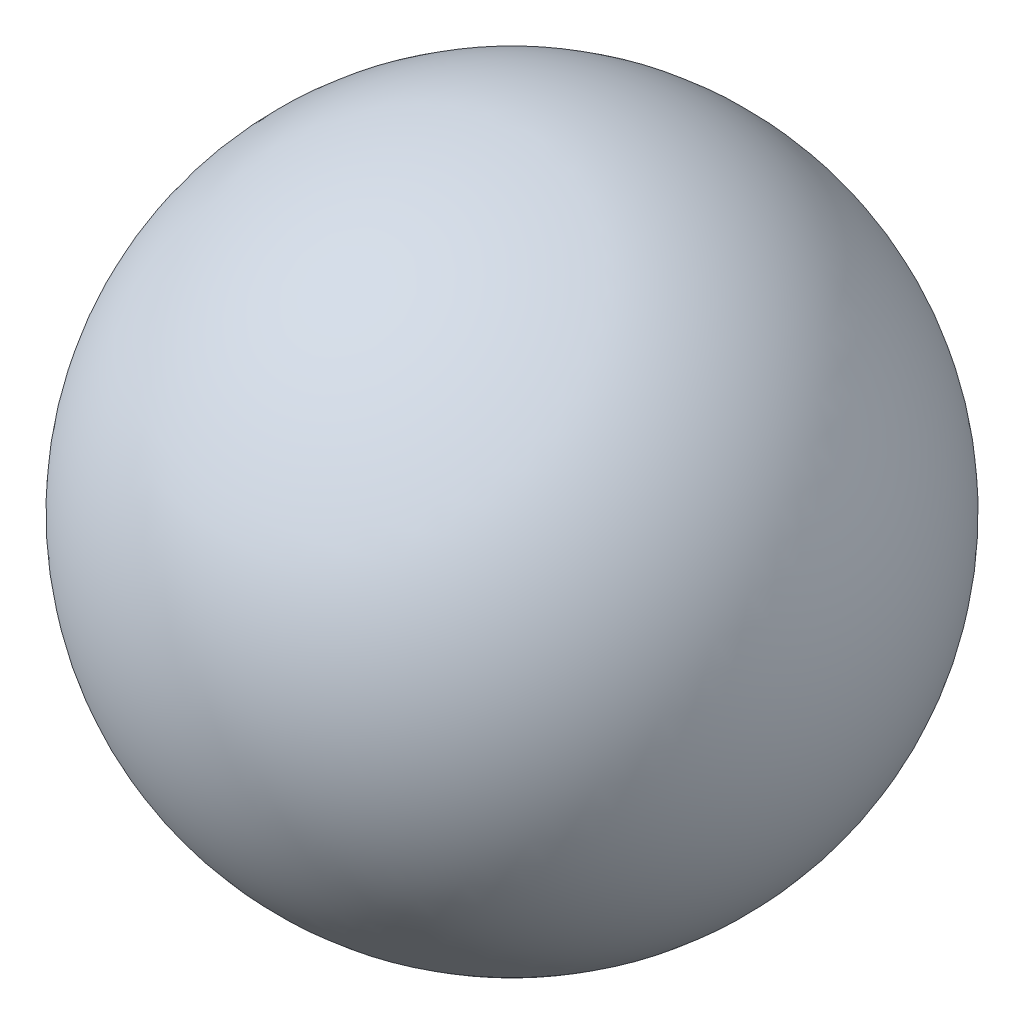
ISO-10303-21;
HEADER;
FILE_DESCRIPTION(('STEP AP214'),'2;1');
FILE_NAME('part.step','',(''),(''),'','','');
FILE_SCHEMA(('AUTOMOTIVE_DESIGN { 1 0 10303 214 1 1 1 1 }'));
ENDSEC;
DATA;
#1=APPLICATION_CONTEXT('core data for automotive mechanical design processes');
#2=APPLICATION_PROTOCOL_DEFINITION('international standard','automotive_design',2000,#1);
#3=PRODUCT_CONTEXT('',#1,'mechanical');
#4=PRODUCT('Part','Part','',(#3));
#5=PRODUCT_RELATED_PRODUCT_CATEGORY('part','',(#4));
#6=PRODUCT_DEFINITION_FORMATION('','',#4);
#7=PRODUCT_DEFINITION_CONTEXT('part definition',#1,'design');
#8=PRODUCT_DEFINITION('design','',#6,#7);
#9=PRODUCT_DEFINITION_SHAPE('','',#8);
#10=(LENGTH_UNIT() NAMED_UNIT(*) SI_UNIT(.MILLI.,.METRE.));
#11=(NAMED_UNIT(*) PLANE_ANGLE_UNIT() SI_UNIT($,.RADIAN.));
#12=(NAMED_UNIT(*) SI_UNIT($,.STERADIAN.) SOLID_ANGLE_UNIT());
#13=UNCERTAINTY_MEASURE_WITH_UNIT(LENGTH_MEASURE(1.E-05),#10,'distance_accuracy_value','');
#14=(GEOMETRIC_REPRESENTATION_CONTEXT(3) GLOBAL_UNCERTAINTY_ASSIGNED_CONTEXT((#13)) GLOBAL_UNIT_ASSIGNED_CONTEXT((#10,
#11,#12)) REPRESENTATION_CONTEXT('',''));
#15=CARTESIAN_POINT('',(0.,0.,0.));
#16=DIRECTION('',(0.,0.,1.));
#17=DIRECTION('',(1.,0.,0.));
#18=AXIS2_PLACEMENT_3D('',#15,#16,#17);
#19=CARTESIAN_POINT('',(0.,-3.35,0.));
#20=DIRECTION('',(0.0436746395810799,0.997954029736576,0.0466934726700802));
#21=DIRECTION('',(-0.990820311528116,0.0372825196496607,0.129942771987905));
#22=AXIS2_PLACEMENT_3D('',#19,#20,#21);
#23=SPHERICAL_SURFACE('',#22,0.794);
#24=CARTESIAN_POINT('',(0.0346776638273775,-2.55762450038916,0.0370746173000671));
#25=VERTEX_POINT('',#24);
#26=VERTEX_LOOP('',#25);
#27=FACE_BOUND('',#26,.T.);
#28=CARTESIAN_POINT('',(-0.0346776638273775,-4.14237549961084,-0.0370746173000203));
#29=VERTEX_POINT('',#28);
#30=VERTEX_LOOP('',#29);
#31=FACE_BOUND('',#30,.T.);
#32=ADVANCED_FACE('F16',(#27,#31),#23,.T.);
#33=CLOSED_SHELL('',(#32));
#34=MANIFOLD_SOLID_BREP('B1',#33);
#35=ADVANCED_BREP_SHAPE_REPRESENTATION('',(#18,#34),#14);
#36=SHAPE_DEFINITION_REPRESENTATION(#9,#35);
ENDSEC;
END-ISO-10303-21;
